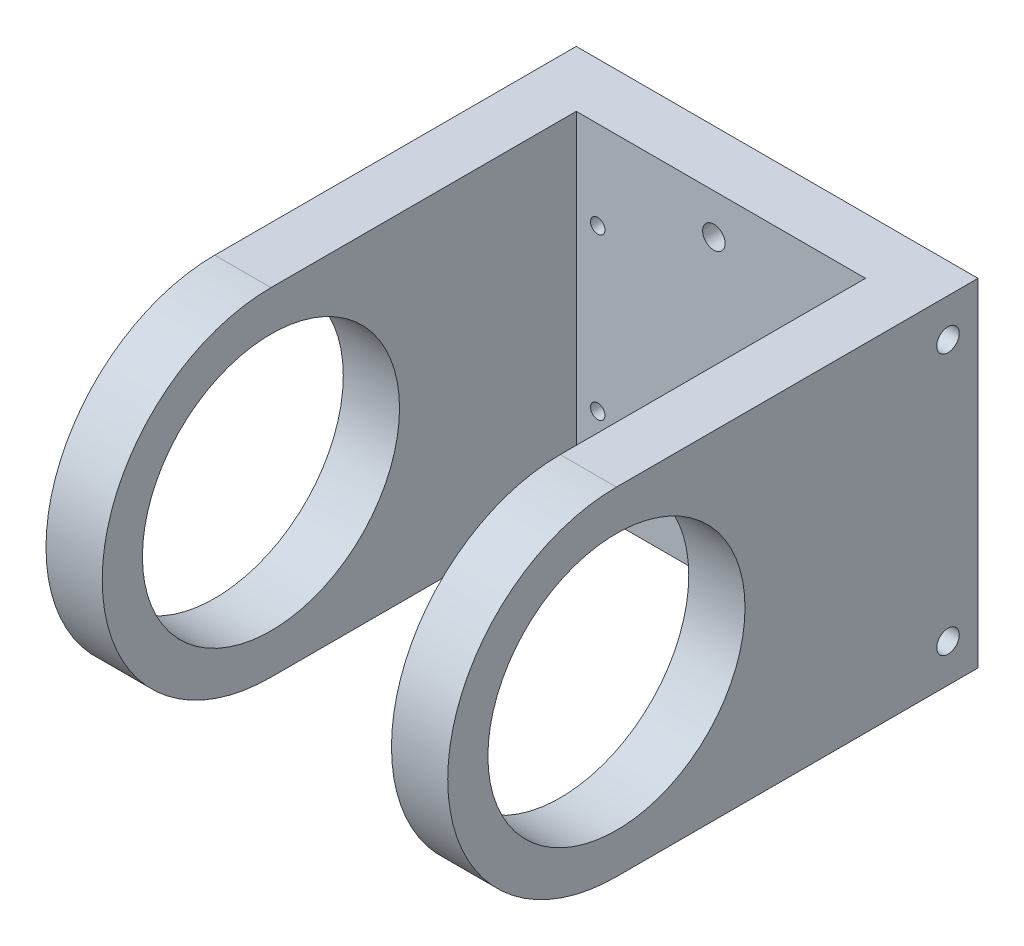
ISO-10303-21;
HEADER;
FILE_DESCRIPTION(('STEP AP214'),'2;1');
FILE_NAME('part.step','',(''),(''),'','','');
FILE_SCHEMA(('AUTOMOTIVE_DESIGN { 1 0 10303 214 1 1 1 1 }'));
ENDSEC;
DATA;
#1=APPLICATION_CONTEXT('core data for automotive mechanical design processes');
#2=APPLICATION_PROTOCOL_DEFINITION('international standard','automotive_design',2000,#1);
#3=PRODUCT_CONTEXT('',#1,'mechanical');
#4=PRODUCT('Part','Part','',(#3));
#5=PRODUCT_RELATED_PRODUCT_CATEGORY('part','',(#4));
#6=PRODUCT_DEFINITION_FORMATION('','',#4);
#7=PRODUCT_DEFINITION_CONTEXT('part definition',#1,'design');
#8=PRODUCT_DEFINITION('design','',#6,#7);
#9=PRODUCT_DEFINITION_SHAPE('','',#8);
#10=(LENGTH_UNIT() NAMED_UNIT(*) SI_UNIT(.MILLI.,.METRE.));
#11=(NAMED_UNIT(*) PLANE_ANGLE_UNIT() SI_UNIT($,.RADIAN.));
#12=(NAMED_UNIT(*) SI_UNIT($,.STERADIAN.) SOLID_ANGLE_UNIT());
#13=UNCERTAINTY_MEASURE_WITH_UNIT(LENGTH_MEASURE(1.E-05),#10,'distance_accuracy_value','');
#14=(GEOMETRIC_REPRESENTATION_CONTEXT(3) GLOBAL_UNCERTAINTY_ASSIGNED_CONTEXT((#13)) GLOBAL_UNIT_ASSIGNED_CONTEXT((#10,
#11,#12)) REPRESENTATION_CONTEXT('',''));
#15=CARTESIAN_POINT('',(0.,0.,0.));
#16=DIRECTION('',(0.,0.,1.));
#17=DIRECTION('',(1.,0.,0.));
#18=AXIS2_PLACEMENT_3D('',#15,#16,#17);
#19=CARTESIAN_POINT('',(-25.,0.,0.));
#20=DIRECTION('',(-1.,0.,0.));
#21=DIRECTION('',(0.,0.,1.));
#22=AXIS2_PLACEMENT_3D('',#19,#20,#21);
#23=CYLINDRICAL_SURFACE('',#22,21.);
#24=CARTESIAN_POINT('',(-68.,0.,0.));
#25=DIRECTION('',(-1.,0.,0.));
#26=DIRECTION('',(0.,0.,1.));
#27=AXIS2_PLACEMENT_3D('',#24,#25,#26);
#28=CIRCLE('',#27,21.);
#29=CARTESIAN_POINT('',(-68.,21.,0.));
#30=VERTEX_POINT('',#29);
#31=CARTESIAN_POINT('',(-68.,-21.,0.));
#32=VERTEX_POINT('',#31);
#33=EDGE_CURVE('E136',#30,#32,#28,.F.);
#34=ORIENTED_EDGE('',*,*,#33,.F.);
#35=DIRECTION('',(-1.,0.,0.));
#36=VECTOR('',#35,1.);
#37=CARTESIAN_POINT('',(-25.,21.,0.));
#38=LINE('',#37,#36);
#39=CARTESIAN_POINT('',(-75.,21.,0.));
#40=VERTEX_POINT('',#39);
#41=EDGE_CURVE('E149',#30,#40,#38,.T.);
#42=ORIENTED_EDGE('',*,*,#41,.T.);
#43=CARTESIAN_POINT('',(-75.,0.,0.));
#44=DIRECTION('',(-1.,0.,0.));
#45=DIRECTION('',(0.,0.,1.));
#46=AXIS2_PLACEMENT_3D('',#43,#44,#45);
#47=CIRCLE('',#46,21.);
#48=CARTESIAN_POINT('',(-75.,-21.,0.));
#49=VERTEX_POINT('',#48);
#50=EDGE_CURVE('E138',#49,#40,#47,.T.);
#51=ORIENTED_EDGE('',*,*,#50,.F.);
#52=DIRECTION('',(-1.,0.,0.));
#53=VECTOR('',#52,1.);
#54=CARTESIAN_POINT('',(-25.,-21.,0.));
#55=LINE('',#54,#53);
#56=EDGE_CURVE('E78',#32,#49,#55,.T.);
#57=ORIENTED_EDGE('',*,*,#56,.F.);
#58=EDGE_LOOP('',(#34,#42,#51,#57));
#59=FACE_BOUND('',#58,.T.);
#60=ADVANCED_FACE('F34',(#59),#23,.T.);
#61=CARTESIAN_POINT('',(-32.,0.,0.));
#62=DIRECTION('',(1.,0.,0.));
#63=DIRECTION('',(0.,0.,-1.));
#64=AXIS2_PLACEMENT_3D('',#61,#62,#63);
#65=CIRCLE('',#64,21.);
#66=CARTESIAN_POINT('',(-32.,-21.,0.));
#67=VERTEX_POINT('',#66);
#68=CARTESIAN_POINT('',(-32.,21.,0.));
#69=VERTEX_POINT('',#68);
#70=EDGE_CURVE('E48',#67,#69,#65,.F.);
#71=ORIENTED_EDGE('',*,*,#70,.F.);
#72=CARTESIAN_POINT('',(-25.,-21.,0.));
#73=VERTEX_POINT('',#72);
#74=EDGE_CURVE('E42',#73,#67,#55,.T.);
#75=ORIENTED_EDGE('',*,*,#74,.F.);
#76=CARTESIAN_POINT('',(-25.,0.,0.));
#77=DIRECTION('',(-1.,0.,0.));
#78=DIRECTION('',(0.,0.,1.));
#79=AXIS2_PLACEMENT_3D('',#76,#77,#78);
#80=CIRCLE('',#79,21.);
#81=CARTESIAN_POINT('',(-25.,21.,0.));
#82=VERTEX_POINT('',#81);
#83=EDGE_CURVE('E139',#73,#82,#80,.T.);
#84=ORIENTED_EDGE('',*,*,#83,.T.);
#85=EDGE_CURVE('E85',#82,#69,#38,.T.);
#86=ORIENTED_EDGE('',*,*,#85,.T.);
#87=EDGE_LOOP('',(#71,#75,#84,#86));
#88=FACE_BOUND('',#87,.T.);
#89=ADVANCED_FACE('F36',(#88),#23,.T.);
#90=CARTESIAN_POINT('',(-25.,-21.,-45.));
#91=DIRECTION('',(0.,-1.,0.));
#92=DIRECTION('',(0.,0.,-1.));
#93=AXIS2_PLACEMENT_3D('',#90,#91,#92);
#94=PLANE('',#93);
#95=DIRECTION('',(0.,0.,1.));
#96=VECTOR('',#95,1.);
#97=CARTESIAN_POINT('',(-68.,-21.,-38.));
#98=LINE('',#97,#96);
#99=CARTESIAN_POINT('',(-68.,-21.,-38.));
#100=VERTEX_POINT('',#99);
#101=EDGE_CURVE('E124',#100,#32,#98,.T.);
#102=ORIENTED_EDGE('',*,*,#101,.T.);
#103=ORIENTED_EDGE('',*,*,#56,.T.);
#104=DIRECTION('',(0.,0.,1.));
#105=VECTOR('',#104,1.);
#106=CARTESIAN_POINT('',(-75.,-21.,-45.));
#107=LINE('',#106,#105);
#108=CARTESIAN_POINT('',(-75.,-21.,-45.));
#109=VERTEX_POINT('',#108);
#110=EDGE_CURVE('E142',#109,#49,#107,.T.);
#111=ORIENTED_EDGE('',*,*,#110,.F.);
#112=DIRECTION('',(-1.,0.,0.));
#113=VECTOR('',#112,1.);
#114=CARTESIAN_POINT('',(-25.,-21.,-45.));
#115=LINE('',#114,#113);
#116=CARTESIAN_POINT('',(-25.,-21.,-45.));
#117=VERTEX_POINT('',#116);
#118=EDGE_CURVE('E161',#117,#109,#115,.T.);
#119=ORIENTED_EDGE('',*,*,#118,.F.);
#120=DIRECTION('',(0.,0.,1.));
#121=VECTOR('',#120,1.);
#122=CARTESIAN_POINT('',(-25.,-21.,-45.));
#123=LINE('',#122,#121);
#124=EDGE_CURVE('E147',#117,#73,#123,.T.);
#125=ORIENTED_EDGE('',*,*,#124,.T.);
#126=ORIENTED_EDGE('',*,*,#74,.T.);
#127=DIRECTION('',(0.,0.,-1.));
#128=VECTOR('',#127,1.);
#129=CARTESIAN_POINT('',(-32.,-21.,64.1638670912921));
#130=LINE('',#129,#128);
#131=CARTESIAN_POINT('',(-32.,-21.,-38.));
#132=VERTEX_POINT('',#131);
#133=EDGE_CURVE('E111',#67,#132,#130,.T.);
#134=ORIENTED_EDGE('',*,*,#133,.T.);
#135=DIRECTION('',(-1.,0.,0.));
#136=VECTOR('',#135,1.);
#137=CARTESIAN_POINT('',(-32.,-21.,-38.));
#138=LINE('',#137,#136);
#139=EDGE_CURVE('E116',#132,#100,#138,.T.);
#140=ORIENTED_EDGE('',*,*,#139,.T.);
#141=EDGE_LOOP('',(#102,#103,#111,#119,#125,#126,#134,#140));
#142=FACE_BOUND('',#141,.T.);
#143=ADVANCED_FACE('F122',(#142),#94,.T.);
#144=CARTESIAN_POINT('',(-25.,21.,-45.));
#145=DIRECTION('',(0.,0.,-1.));
#146=DIRECTION('',(-1.,0.,0.));
#147=AXIS2_PLACEMENT_3D('',#144,#145,#146);
#148=PLANE('',#147);
#149=CARTESIAN_POINT('',(-50.8768179848165,16.,-45.));
#150=DIRECTION('',(0.,0.,-1.));
#151=DIRECTION('',(-1.,0.,0.));
#152=AXIS2_PLACEMENT_3D('',#149,#150,#151);
#153=CIRCLE('',#152,1.4);
#154=CARTESIAN_POINT('',(-52.2768179848165,16.,-45.));
#155=VERTEX_POINT('',#154);
#156=EDGE_CURVE('E452',#155,#155,#153,.T.);
#157=ORIENTED_EDGE('',*,*,#156,.F.);
#158=EDGE_LOOP('',(#157));
#159=FACE_BOUND('',#158,.T.);
#160=CARTESIAN_POINT('',(-50.8768179848165,-16.,-45.));
#161=DIRECTION('',(0.,0.,-1.));
#162=DIRECTION('',(-1.,0.,0.));
#163=AXIS2_PLACEMENT_3D('',#160,#161,#162);
#164=CIRCLE('',#163,1.4);
#165=CARTESIAN_POINT('',(-52.2768179848165,-16.,-45.));
#166=VERTEX_POINT('',#165);
#167=EDGE_CURVE('E458',#166,#166,#164,.T.);
#168=ORIENTED_EDGE('',*,*,#167,.F.);
#169=EDGE_LOOP('',(#168));
#170=FACE_BOUND('',#169,.T.);
#171=CARTESIAN_POINT('',(-35.3332236,10.,-45.));
#172=DIRECTION('',(0.,0.,-1.));
#173=DIRECTION('',(-1.,0.,0.));
#174=AXIS2_PLACEMENT_3D('',#171,#172,#173);
#175=CIRCLE('',#174,0.899999999999998);
#176=CARTESIAN_POINT('',(-36.2332236,10.,-45.));
#177=VERTEX_POINT('',#176);
#178=EDGE_CURVE('E473',#177,#177,#175,.T.);
#179=ORIENTED_EDGE('',*,*,#178,.F.);
#180=EDGE_LOOP('',(#179));
#181=FACE_BOUND('',#180,.T.);
#182=CARTESIAN_POINT('',(-65.3332236,10.,-45.));
#183=DIRECTION('',(0.,0.,-1.));
#184=DIRECTION('',(-1.,0.,0.));
#185=AXIS2_PLACEMENT_3D('',#182,#183,#184);
#186=CIRCLE('',#185,0.899999999999998);
#187=CARTESIAN_POINT('',(-66.2332236,10.,-45.));
#188=VERTEX_POINT('',#187);
#189=EDGE_CURVE('E479',#188,#188,#186,.T.);
#190=ORIENTED_EDGE('',*,*,#189,.F.);
#191=EDGE_LOOP('',(#190));
#192=FACE_BOUND('',#191,.T.);
#193=CARTESIAN_POINT('',(-35.3332236,-10.,-45.));
#194=DIRECTION('',(0.,0.,-1.));
#195=DIRECTION('',(-1.,0.,0.));
#196=AXIS2_PLACEMENT_3D('',#193,#194,#195);
#197=CIRCLE('',#196,0.899999999999998);
#198=CARTESIAN_POINT('',(-36.2332236,-10.,-45.));
#199=VERTEX_POINT('',#198);
#200=EDGE_CURVE('E485',#199,#199,#197,.T.);
#201=ORIENTED_EDGE('',*,*,#200,.F.);
#202=EDGE_LOOP('',(#201));
#203=FACE_BOUND('',#202,.T.);
#204=CARTESIAN_POINT('',(-65.3332236,-10.,-45.));
#205=DIRECTION('',(0.,0.,-1.));
#206=DIRECTION('',(-1.,0.,0.));
#207=AXIS2_PLACEMENT_3D('',#204,#205,#206);
#208=CIRCLE('',#207,0.899999999999998);
#209=CARTESIAN_POINT('',(-66.2332236,-10.,-45.));
#210=VERTEX_POINT('',#209);
#211=EDGE_CURVE('E491',#210,#210,#208,.T.);
#212=ORIENTED_EDGE('',*,*,#211,.F.);
#213=EDGE_LOOP('',(#212));
#214=FACE_BOUND('',#213,.T.);
#215=DIRECTION('',(0.,-1.,0.));
#216=VECTOR('',#215,1.);
#217=CARTESIAN_POINT('',(-75.,21.,-45.));
#218=LINE('',#217,#216);
#219=CARTESIAN_POINT('',(-75.,21.,-45.));
#220=VERTEX_POINT('',#219);
#221=EDGE_CURVE('E155',#220,#109,#218,.T.);
#222=ORIENTED_EDGE('',*,*,#221,.F.);
#223=DIRECTION('',(-1.,0.,0.));
#224=VECTOR('',#223,1.);
#225=CARTESIAN_POINT('',(-25.,21.,-45.));
#226=LINE('',#225,#224);
#227=CARTESIAN_POINT('',(-25.,21.,-45.));
#228=VERTEX_POINT('',#227);
#229=EDGE_CURVE('E163',#228,#220,#226,.T.);
#230=ORIENTED_EDGE('',*,*,#229,.F.);
#231=DIRECTION('',(0.,-1.,0.));
#232=VECTOR('',#231,1.);
#233=CARTESIAN_POINT('',(-25.,21.,-45.));
#234=LINE('',#233,#232);
#235=EDGE_CURVE('E144',#228,#117,#234,.T.);
#236=ORIENTED_EDGE('',*,*,#235,.T.);
#237=ORIENTED_EDGE('',*,*,#118,.T.);
#238=EDGE_LOOP('',(#222,#230,#236,#237));
#239=FACE_BOUND('',#238,.T.);
#240=ADVANCED_FACE('F176',(#159,#170,#181,#192,#203,#214,#239),#148,.T.);
#241=CARTESIAN_POINT('',(-25.,21.,0.));
#242=DIRECTION('',(0.,1.,0.));
#243=DIRECTION('',(0.,0.,1.));
#244=AXIS2_PLACEMENT_3D('',#241,#242,#243);
#245=PLANE('',#244);
#246=DIRECTION('',(0.,0.,1.));
#247=VECTOR('',#246,1.);
#248=CARTESIAN_POINT('',(-68.,21.,-38.));
#249=LINE('',#248,#247);
#250=CARTESIAN_POINT('',(-68.,21.,-38.));
#251=VERTEX_POINT('',#250);
#252=EDGE_CURVE('E130',#251,#30,#249,.T.);
#253=ORIENTED_EDGE('',*,*,#252,.F.);
#254=DIRECTION('',(-1.,0.,0.));
#255=VECTOR('',#254,1.);
#256=CARTESIAN_POINT('',(-32.,21.,-38.));
#257=LINE('',#256,#255);
#258=CARTESIAN_POINT('',(-32.,21.,-38.));
#259=VERTEX_POINT('',#258);
#260=EDGE_CURVE('E126',#259,#251,#257,.T.);
#261=ORIENTED_EDGE('',*,*,#260,.F.);
#262=DIRECTION('',(0.,0.,-1.));
#263=VECTOR('',#262,1.);
#264=CARTESIAN_POINT('',(-32.,21.,0.));
#265=LINE('',#264,#263);
#266=EDGE_CURVE('E11',#69,#259,#265,.T.);
#267=ORIENTED_EDGE('',*,*,#266,.F.);
#268=ORIENTED_EDGE('',*,*,#85,.F.);
#269=DIRECTION('',(0.,0.,-1.));
#270=VECTOR('',#269,1.);
#271=CARTESIAN_POINT('',(-25.,21.,0.));
#272=LINE('',#271,#270);
#273=EDGE_CURVE('E141',#82,#228,#272,.T.);
#274=ORIENTED_EDGE('',*,*,#273,.T.);
#275=ORIENTED_EDGE('',*,*,#229,.T.);
#276=DIRECTION('',(0.,0.,-1.));
#277=VECTOR('',#276,1.);
#278=CARTESIAN_POINT('',(-75.,21.,0.));
#279=LINE('',#278,#277);
#280=EDGE_CURVE('E152',#40,#220,#279,.T.);
#281=ORIENTED_EDGE('',*,*,#280,.F.);
#282=ORIENTED_EDGE('',*,*,#41,.F.);
#283=EDGE_LOOP('',(#253,#261,#267,#268,#274,#275,#281,#282));
#284=FACE_BOUND('',#283,.T.);
#285=ADVANCED_FACE('F169',(#284),#245,.T.);
#286=CARTESIAN_POINT('',(-25.,0.,0.));
#287=DIRECTION('',(-1.,0.,0.));
#288=DIRECTION('',(0.,0.,1.));
#289=AXIS2_PLACEMENT_3D('',#286,#287,#288);
#290=PLANE('',#289);
#291=CARTESIAN_POINT('',(-25.,-16.25,-41.2671434810346));
#292=DIRECTION('',(1.,0.,0.));
#293=DIRECTION('',(0.,0.,-1.));
#294=AXIS2_PLACEMENT_3D('',#291,#292,#293);
#295=CIRCLE('',#294,1.4);
#296=CARTESIAN_POINT('',(-25.,-16.25,-42.6671434810346));
#297=VERTEX_POINT('',#296);
#298=EDGE_CURVE('E436',#297,#297,#295,.T.);
#299=ORIENTED_EDGE('',*,*,#298,.F.);
#300=EDGE_LOOP('',(#299));
#301=FACE_BOUND('',#300,.T.);
#302=CARTESIAN_POINT('',(-25.,16.25,-41.2671434810346));
#303=DIRECTION('',(1.,0.,0.));
#304=DIRECTION('',(0.,0.,-1.));
#305=AXIS2_PLACEMENT_3D('',#302,#303,#304);
#306=CIRCLE('',#305,1.4);
#307=CARTESIAN_POINT('',(-25.,16.25,-42.6671434810346));
#308=VERTEX_POINT('',#307);
#309=EDGE_CURVE('E441',#308,#308,#306,.T.);
#310=ORIENTED_EDGE('',*,*,#309,.F.);
#311=EDGE_LOOP('',(#310));
#312=FACE_BOUND('',#311,.T.);
#313=CARTESIAN_POINT('',(-25.,0.,0.));
#314=DIRECTION('',(1.,0.,0.));
#315=DIRECTION('',(0.,0.,-1.));
#316=AXIS2_PLACEMENT_3D('',#313,#314,#315);
#317=CIRCLE('',#316,16.);
#318=CARTESIAN_POINT('',(-25.,0.,-16.));
#319=VERTEX_POINT('',#318);
#320=EDGE_CURVE('E467',#319,#319,#317,.T.);
#321=ORIENTED_EDGE('',*,*,#320,.F.);
#322=EDGE_LOOP('',(#321));
#323=FACE_BOUND('',#322,.T.);
#324=ORIENTED_EDGE('',*,*,#83,.F.);
#325=ORIENTED_EDGE('',*,*,#124,.F.);
#326=ORIENTED_EDGE('',*,*,#235,.F.);
#327=ORIENTED_EDGE('',*,*,#273,.F.);
#328=EDGE_LOOP('',(#324,#325,#326,#327));
#329=FACE_BOUND('',#328,.T.);
#330=ADVANCED_FACE('F178',(#301,#312,#323,#329),#290,.F.);
#331=CARTESIAN_POINT('',(-75.,0.,0.));
#332=DIRECTION('',(-1.,0.,0.));
#333=DIRECTION('',(0.,0.,1.));
#334=AXIS2_PLACEMENT_3D('',#331,#332,#333);
#335=PLANE('',#334);
#336=CARTESIAN_POINT('',(-75.,-16.25,-41.2671434810346));
#337=DIRECTION('',(1.,0.,0.));
#338=DIRECTION('',(0.,0.,-1.));
#339=AXIS2_PLACEMENT_3D('',#336,#337,#338);
#340=CIRCLE('',#339,1.4);
#341=CARTESIAN_POINT('',(-75.,-16.25,-42.6671434810346));
#342=VERTEX_POINT('',#341);
#343=EDGE_CURVE('E427',#342,#342,#340,.T.);
#344=ORIENTED_EDGE('',*,*,#343,.T.);
#345=EDGE_LOOP('',(#344));
#346=FACE_BOUND('',#345,.T.);
#347=CARTESIAN_POINT('',(-75.,16.25,-41.2671434810346));
#348=DIRECTION('',(1.,0.,0.));
#349=DIRECTION('',(0.,0.,-1.));
#350=AXIS2_PLACEMENT_3D('',#347,#348,#349);
#351=CIRCLE('',#350,1.4);
#352=CARTESIAN_POINT('',(-75.,16.25,-42.6671434810346));
#353=VERTEX_POINT('',#352);
#354=EDGE_CURVE('E426',#353,#353,#351,.T.);
#355=ORIENTED_EDGE('',*,*,#354,.T.);
#356=EDGE_LOOP('',(#355));
#357=FACE_BOUND('',#356,.T.);
#358=CARTESIAN_POINT('',(-75.,0.,0.));
#359=DIRECTION('',(-1.,0.,0.));
#360=DIRECTION('',(0.,0.,1.));
#361=AXIS2_PLACEMENT_3D('',#358,#359,#360);
#362=CIRCLE('',#361,16.);
#363=CARTESIAN_POINT('',(-75.,0.,16.));
#364=VERTEX_POINT('',#363);
#365=EDGE_CURVE('E461',#364,#364,#362,.T.);
#366=ORIENTED_EDGE('',*,*,#365,.F.);
#367=EDGE_LOOP('',(#366));
#368=FACE_BOUND('',#367,.T.);
#369=ORIENTED_EDGE('',*,*,#50,.T.);
#370=ORIENTED_EDGE('',*,*,#280,.T.);
#371=ORIENTED_EDGE('',*,*,#221,.T.);
#372=ORIENTED_EDGE('',*,*,#110,.T.);
#373=EDGE_LOOP('',(#369,#370,#371,#372));
#374=FACE_BOUND('',#373,.T.);
#375=ADVANCED_FACE('F172',(#346,#357,#368,#374),#335,.T.);
#376=CARTESIAN_POINT('',(-68.,-21.,-38.));
#377=DIRECTION('',(-1.,0.,0.));
#378=DIRECTION('',(0.,0.,1.));
#379=AXIS2_PLACEMENT_3D('',#376,#377,#378);
#380=PLANE('',#379);
#381=CARTESIAN_POINT('',(-68.,0.,0.));
#382=DIRECTION('',(-1.,0.,0.));
#383=DIRECTION('',(0.,0.,1.));
#384=AXIS2_PLACEMENT_3D('',#381,#382,#383);
#385=CIRCLE('',#384,16.);
#386=CARTESIAN_POINT('',(-68.,0.,16.));
#387=VERTEX_POINT('',#386);
#388=EDGE_CURVE('E464',#387,#387,#385,.T.);
#389=ORIENTED_EDGE('',*,*,#388,.T.);
#390=EDGE_LOOP('',(#389));
#391=FACE_BOUND('',#390,.T.);
#392=ORIENTED_EDGE('',*,*,#33,.T.);
#393=ORIENTED_EDGE('',*,*,#101,.F.);
#394=DIRECTION('',(0.,1.,0.));
#395=VECTOR('',#394,1.);
#396=CARTESIAN_POINT('',(-68.,-21.,-38.));
#397=LINE('',#396,#395);
#398=EDGE_CURVE('E115',#100,#251,#397,.T.);
#399=ORIENTED_EDGE('',*,*,#398,.T.);
#400=ORIENTED_EDGE('',*,*,#252,.T.);
#401=EDGE_LOOP('',(#392,#393,#399,#400));
#402=FACE_BOUND('',#401,.T.);
#403=ADVANCED_FACE('F279',(#391,#402),#380,.F.);
#404=CARTESIAN_POINT('',(-32.,-21.,-38.));
#405=DIRECTION('',(0.,0.,-1.));
#406=DIRECTION('',(-1.,0.,0.));
#407=AXIS2_PLACEMENT_3D('',#404,#405,#406);
#408=PLANE('',#407);
#409=CARTESIAN_POINT('',(-50.8768179848165,16.,-38.));
#410=DIRECTION('',(0.,0.,1.));
#411=DIRECTION('',(1.,0.,0.));
#412=AXIS2_PLACEMENT_3D('',#409,#410,#411);
#413=CIRCLE('',#412,1.4);
#414=CARTESIAN_POINT('',(-49.4768179848165,16.,-38.));
#415=VERTEX_POINT('',#414);
#416=EDGE_CURVE('E447',#415,#415,#413,.T.);
#417=ORIENTED_EDGE('',*,*,#416,.F.);
#418=EDGE_LOOP('',(#417));
#419=FACE_BOUND('',#418,.T.);
#420=CARTESIAN_POINT('',(-50.8768179848165,-16.,-38.));
#421=DIRECTION('',(0.,0.,1.));
#422=DIRECTION('',(1.,0.,0.));
#423=AXIS2_PLACEMENT_3D('',#420,#421,#422);
#424=CIRCLE('',#423,1.4);
#425=CARTESIAN_POINT('',(-49.4768179848165,-16.,-38.));
#426=VERTEX_POINT('',#425);
#427=EDGE_CURVE('E455',#426,#426,#424,.T.);
#428=ORIENTED_EDGE('',*,*,#427,.F.);
#429=EDGE_LOOP('',(#428));
#430=FACE_BOUND('',#429,.T.);
#431=CARTESIAN_POINT('',(-35.3332236,10.,-38.));
#432=DIRECTION('',(0.,0.,-1.));
#433=DIRECTION('',(-1.,0.,0.));
#434=AXIS2_PLACEMENT_3D('',#431,#432,#433);
#435=CIRCLE('',#434,0.899999999999998);
#436=CARTESIAN_POINT('',(-36.2332236,10.,-38.));
#437=VERTEX_POINT('',#436);
#438=EDGE_CURVE('E476',#437,#437,#435,.T.);
#439=ORIENTED_EDGE('',*,*,#438,.T.);
#440=EDGE_LOOP('',(#439));
#441=FACE_BOUND('',#440,.T.);
#442=CARTESIAN_POINT('',(-65.3332236,10.,-38.));
#443=DIRECTION('',(0.,0.,-1.));
#444=DIRECTION('',(-1.,0.,0.));
#445=AXIS2_PLACEMENT_3D('',#442,#443,#444);
#446=CIRCLE('',#445,0.899999999999998);
#447=CARTESIAN_POINT('',(-66.2332236,10.,-38.));
#448=VERTEX_POINT('',#447);
#449=EDGE_CURVE('E482',#448,#448,#446,.T.);
#450=ORIENTED_EDGE('',*,*,#449,.T.);
#451=EDGE_LOOP('',(#450));
#452=FACE_BOUND('',#451,.T.);
#453=CARTESIAN_POINT('',(-35.3332236,-10.,-38.));
#454=DIRECTION('',(0.,0.,-1.));
#455=DIRECTION('',(-1.,0.,0.));
#456=AXIS2_PLACEMENT_3D('',#453,#454,#455);
#457=CIRCLE('',#456,0.899999999999998);
#458=CARTESIAN_POINT('',(-36.2332236,-10.,-38.));
#459=VERTEX_POINT('',#458);
#460=EDGE_CURVE('E488',#459,#459,#457,.T.);
#461=ORIENTED_EDGE('',*,*,#460,.T.);
#462=EDGE_LOOP('',(#461));
#463=FACE_BOUND('',#462,.T.);
#464=CARTESIAN_POINT('',(-65.3332236,-10.,-38.));
#465=DIRECTION('',(0.,0.,-1.));
#466=DIRECTION('',(-1.,0.,0.));
#467=AXIS2_PLACEMENT_3D('',#464,#465,#466);
#468=CIRCLE('',#467,0.899999999999998);
#469=CARTESIAN_POINT('',(-66.2332236,-10.,-38.));
#470=VERTEX_POINT('',#469);
#471=EDGE_CURVE('E132',#470,#470,#468,.T.);
#472=ORIENTED_EDGE('',*,*,#471,.T.);
#473=EDGE_LOOP('',(#472));
#474=FACE_BOUND('',#473,.T.);
#475=ORIENTED_EDGE('',*,*,#260,.T.);
#476=ORIENTED_EDGE('',*,*,#398,.F.);
#477=ORIENTED_EDGE('',*,*,#139,.F.);
#478=DIRECTION('',(0.,1.,0.));
#479=VECTOR('',#478,1.);
#480=CARTESIAN_POINT('',(-32.,-21.,-38.));
#481=LINE('',#480,#479);
#482=EDGE_CURVE('E107',#132,#259,#481,.T.);
#483=ORIENTED_EDGE('',*,*,#482,.T.);
#484=EDGE_LOOP('',(#475,#476,#477,#483));
#485=FACE_BOUND('',#484,.T.);
#486=ADVANCED_FACE('F119',(#419,#430,#441,#452,#463,#474,#485),#408,.F.);
#487=CARTESIAN_POINT('',(-32.,-21.,64.1638670912921));
#488=DIRECTION('',(1.,0.,0.));
#489=DIRECTION('',(0.,0.,-1.));
#490=AXIS2_PLACEMENT_3D('',#487,#488,#489);
#491=PLANE('',#490);
#492=CARTESIAN_POINT('',(-32.,0.,0.));
#493=DIRECTION('',(1.,0.,0.));
#494=DIRECTION('',(0.,0.,-1.));
#495=AXIS2_PLACEMENT_3D('',#492,#493,#494);
#496=CIRCLE('',#495,16.);
#497=CARTESIAN_POINT('',(-32.,0.,-16.));
#498=VERTEX_POINT('',#497);
#499=EDGE_CURVE('E470',#498,#498,#496,.T.);
#500=ORIENTED_EDGE('',*,*,#499,.T.);
#501=EDGE_LOOP('',(#500));
#502=FACE_BOUND('',#501,.T.);
#503=ORIENTED_EDGE('',*,*,#70,.T.);
#504=ORIENTED_EDGE('',*,*,#266,.T.);
#505=ORIENTED_EDGE('',*,*,#482,.F.);
#506=ORIENTED_EDGE('',*,*,#133,.F.);
#507=EDGE_LOOP('',(#503,#504,#505,#506));
#508=FACE_BOUND('',#507,.T.);
#509=ADVANCED_FACE('F109',(#502,#508),#491,.F.);
#510=CARTESIAN_POINT('',(-65.3332236,-10.,-45.));
#511=DIRECTION('',(0.,0.,-1.));
#512=DIRECTION('',(-1.,0.,0.));
#513=AXIS2_PLACEMENT_3D('',#510,#511,#512);
#514=CYLINDRICAL_SURFACE('',#513,0.899999999999998);
#515=ORIENTED_EDGE('',*,*,#471,.F.);
#516=EDGE_LOOP('',(#515));
#517=FACE_BOUND('',#516,.T.);
#518=ORIENTED_EDGE('',*,*,#211,.T.);
#519=EDGE_LOOP('',(#518));
#520=FACE_BOUND('',#519,.T.);
#521=ADVANCED_FACE('F215',(#517,#520),#514,.F.);
#522=CARTESIAN_POINT('',(-35.3332236,-10.,-45.));
#523=DIRECTION('',(0.,0.,-1.));
#524=DIRECTION('',(-1.,0.,0.));
#525=AXIS2_PLACEMENT_3D('',#522,#523,#524);
#526=CYLINDRICAL_SURFACE('',#525,0.899999999999998);
#527=ORIENTED_EDGE('',*,*,#460,.F.);
#528=EDGE_LOOP('',(#527));
#529=FACE_BOUND('',#528,.T.);
#530=ORIENTED_EDGE('',*,*,#200,.T.);
#531=EDGE_LOOP('',(#530));
#532=FACE_BOUND('',#531,.T.);
#533=ADVANCED_FACE('F220',(#529,#532),#526,.F.);
#534=CARTESIAN_POINT('',(-65.3332236,10.,-45.));
#535=DIRECTION('',(0.,0.,-1.));
#536=DIRECTION('',(-1.,0.,0.));
#537=AXIS2_PLACEMENT_3D('',#534,#535,#536);
#538=CYLINDRICAL_SURFACE('',#537,0.899999999999998);
#539=ORIENTED_EDGE('',*,*,#449,.F.);
#540=EDGE_LOOP('',(#539));
#541=FACE_BOUND('',#540,.T.);
#542=ORIENTED_EDGE('',*,*,#189,.T.);
#543=EDGE_LOOP('',(#542));
#544=FACE_BOUND('',#543,.T.);
#545=ADVANCED_FACE('F232',(#541,#544),#538,.F.);
#546=CARTESIAN_POINT('',(-35.3332236,10.,-45.));
#547=DIRECTION('',(0.,0.,-1.));
#548=DIRECTION('',(-1.,0.,0.));
#549=AXIS2_PLACEMENT_3D('',#546,#547,#548);
#550=CYLINDRICAL_SURFACE('',#549,0.899999999999998);
#551=ORIENTED_EDGE('',*,*,#438,.F.);
#552=EDGE_LOOP('',(#551));
#553=FACE_BOUND('',#552,.T.);
#554=ORIENTED_EDGE('',*,*,#178,.T.);
#555=EDGE_LOOP('',(#554));
#556=FACE_BOUND('',#555,.T.);
#557=ADVANCED_FACE('F242',(#553,#556),#550,.F.);
#558=CARTESIAN_POINT('',(-25.,0.,0.));
#559=DIRECTION('',(1.,0.,0.));
#560=DIRECTION('',(0.,0.,-1.));
#561=AXIS2_PLACEMENT_3D('',#558,#559,#560);
#562=CYLINDRICAL_SURFACE('',#561,16.);
#563=ORIENTED_EDGE('',*,*,#499,.F.);
#564=EDGE_LOOP('',(#563));
#565=FACE_BOUND('',#564,.T.);
#566=ORIENTED_EDGE('',*,*,#320,.T.);
#567=EDGE_LOOP('',(#566));
#568=FACE_BOUND('',#567,.T.);
#569=ADVANCED_FACE('F252',(#565,#568),#562,.F.);
#570=CARTESIAN_POINT('',(-75.,0.,0.));
#571=DIRECTION('',(-1.,0.,0.));
#572=DIRECTION('',(0.,0.,1.));
#573=AXIS2_PLACEMENT_3D('',#570,#571,#572);
#574=CYLINDRICAL_SURFACE('',#573,16.);
#575=ORIENTED_EDGE('',*,*,#388,.F.);
#576=EDGE_LOOP('',(#575));
#577=FACE_BOUND('',#576,.T.);
#578=ORIENTED_EDGE('',*,*,#365,.T.);
#579=EDGE_LOOP('',(#578));
#580=FACE_BOUND('',#579,.T.);
#581=ADVANCED_FACE('F271',(#577,#580),#574,.F.);
#582=CARTESIAN_POINT('',(-50.8768179848165,-16.,-48.));
#583=DIRECTION('',(0.,0.,1.));
#584=DIRECTION('',(1.,0.,0.));
#585=AXIS2_PLACEMENT_3D('',#582,#583,#584);
#586=CYLINDRICAL_SURFACE('',#585,1.4);
#587=ORIENTED_EDGE('',*,*,#167,.T.);
#588=EDGE_LOOP('',(#587));
#589=FACE_BOUND('',#588,.T.);
#590=ORIENTED_EDGE('',*,*,#427,.T.);
#591=EDGE_LOOP('',(#590));
#592=FACE_BOUND('',#591,.T.);
#593=ADVANCED_FACE('F291',(#589,#592),#586,.F.);
#594=CARTESIAN_POINT('',(-50.8768179848165,16.,-48.));
#595=DIRECTION('',(0.,0.,1.));
#596=DIRECTION('',(1.,0.,0.));
#597=AXIS2_PLACEMENT_3D('',#594,#595,#596);
#598=CYLINDRICAL_SURFACE('',#597,1.4);
#599=ORIENTED_EDGE('',*,*,#156,.T.);
#600=EDGE_LOOP('',(#599));
#601=FACE_BOUND('',#600,.T.);
#602=ORIENTED_EDGE('',*,*,#416,.T.);
#603=EDGE_LOOP('',(#602));
#604=FACE_BOUND('',#603,.T.);
#605=ADVANCED_FACE('F315',(#601,#604),#598,.F.);
#606=CARTESIAN_POINT('',(-29.,16.25,-41.2671434810346));
#607=DIRECTION('',(1.,0.,0.));
#608=DIRECTION('',(0.,0.,-1.));
#609=AXIS2_PLACEMENT_3D('',#606,#607,#608);
#610=CYLINDRICAL_SURFACE('',#609,1.4);
#611=CARTESIAN_POINT('',(-29.,16.25,-41.2671434810346));
#612=DIRECTION('',(1.,0.,0.));
#613=DIRECTION('',(0.,0.,-1.));
#614=AXIS2_PLACEMENT_3D('',#611,#612,#613);
#615=CIRCLE('',#614,1.4);
#616=CARTESIAN_POINT('',(-29.,16.25,-42.6671434810346));
#617=VERTEX_POINT('',#616);
#618=EDGE_CURVE('E444',#617,#617,#615,.T.);
#619=ORIENTED_EDGE('',*,*,#618,.F.);
#620=EDGE_LOOP('',(#619));
#621=FACE_BOUND('',#620,.T.);
#622=ORIENTED_EDGE('',*,*,#309,.T.);
#623=EDGE_LOOP('',(#622));
#624=FACE_BOUND('',#623,.T.);
#625=ADVANCED_FACE('F325',(#621,#624),#610,.F.);
#626=CARTESIAN_POINT('',(-29.,16.25,-41.2671434810346));
#627=DIRECTION('',(1.,0.,0.));
#628=DIRECTION('',(0.,0.,-1.));
#629=AXIS2_PLACEMENT_3D('',#626,#627,#628);
#630=PLANE('',#629);
#631=ORIENTED_EDGE('',*,*,#618,.T.);
#632=EDGE_LOOP('',(#631));
#633=FACE_BOUND('',#632,.T.);
#634=ADVANCED_FACE('F342',(#633),#630,.T.);
#635=CARTESIAN_POINT('',(-29.,-16.25,-41.2671434810346));
#636=DIRECTION('',(1.,0.,0.));
#637=DIRECTION('',(0.,0.,-1.));
#638=AXIS2_PLACEMENT_3D('',#635,#636,#637);
#639=CYLINDRICAL_SURFACE('',#638,1.4);
#640=CARTESIAN_POINT('',(-29.,-16.25,-41.2671434810346));
#641=DIRECTION('',(1.,0.,0.));
#642=DIRECTION('',(0.,0.,-1.));
#643=AXIS2_PLACEMENT_3D('',#640,#641,#642);
#644=CIRCLE('',#643,1.4);
#645=CARTESIAN_POINT('',(-29.,-16.25,-42.6671434810346));
#646=VERTEX_POINT('',#645);
#647=EDGE_CURVE('E438',#646,#646,#644,.T.);
#648=ORIENTED_EDGE('',*,*,#647,.F.);
#649=EDGE_LOOP('',(#648));
#650=FACE_BOUND('',#649,.T.);
#651=ORIENTED_EDGE('',*,*,#298,.T.);
#652=EDGE_LOOP('',(#651));
#653=FACE_BOUND('',#652,.T.);
#654=ADVANCED_FACE('F352',(#650,#653),#639,.F.);
#655=CARTESIAN_POINT('',(-29.,-16.25,-41.2671434810346));
#656=DIRECTION('',(1.,0.,0.));
#657=DIRECTION('',(0.,0.,-1.));
#658=AXIS2_PLACEMENT_3D('',#655,#656,#657);
#659=PLANE('',#658);
#660=ORIENTED_EDGE('',*,*,#647,.T.);
#661=EDGE_LOOP('',(#660));
#662=FACE_BOUND('',#661,.T.);
#663=ADVANCED_FACE('F362',(#662),#659,.T.);
#664=CARTESIAN_POINT('',(-71.,16.25,-41.2671434810346));
#665=DIRECTION('',(-1.,0.,0.));
#666=DIRECTION('',(0.,0.,1.));
#667=AXIS2_PLACEMENT_3D('',#664,#665,#666);
#668=CYLINDRICAL_SURFACE('',#667,1.4);
#669=CARTESIAN_POINT('',(-71.,16.25,-41.2671434810346));
#670=DIRECTION('',(1.,0.,0.));
#671=DIRECTION('',(0.,0.,-1.));
#672=AXIS2_PLACEMENT_3D('',#669,#670,#671);
#673=CIRCLE('',#672,1.4);
#674=CARTESIAN_POINT('',(-71.,16.25,-42.6671434810346));
#675=VERTEX_POINT('',#674);
#676=EDGE_CURVE('E430',#675,#675,#673,.T.);
#677=ORIENTED_EDGE('',*,*,#676,.T.);
#678=EDGE_LOOP('',(#677));
#679=FACE_BOUND('',#678,.T.);
#680=ORIENTED_EDGE('',*,*,#354,.F.);
#681=EDGE_LOOP('',(#680));
#682=FACE_BOUND('',#681,.T.);
#683=ADVANCED_FACE('F372',(#679,#682),#668,.F.);
#684=CARTESIAN_POINT('',(-71.,16.25,-41.2671434810346));
#685=DIRECTION('',(-1.,0.,0.));
#686=DIRECTION('',(0.,0.,-1.));
#687=AXIS2_PLACEMENT_3D('',#684,#685,#686);
#688=PLANE('',#687);
#689=ORIENTED_EDGE('',*,*,#676,.F.);
#690=EDGE_LOOP('',(#689));
#691=FACE_BOUND('',#690,.T.);
#692=ADVANCED_FACE('F389',(#691),#688,.T.);
#693=CARTESIAN_POINT('',(-71.,-16.25,-41.2671434810346));
#694=DIRECTION('',(-1.,0.,0.));
#695=DIRECTION('',(0.,0.,1.));
#696=AXIS2_PLACEMENT_3D('',#693,#694,#695);
#697=CYLINDRICAL_SURFACE('',#696,1.4);
#698=CARTESIAN_POINT('',(-71.,-16.25,-41.2671434810346));
#699=DIRECTION('',(1.,0.,0.));
#700=DIRECTION('',(0.,0.,-1.));
#701=AXIS2_PLACEMENT_3D('',#698,#699,#700);
#702=CIRCLE('',#701,1.4);
#703=CARTESIAN_POINT('',(-71.,-16.25,-42.6671434810346));
#704=VERTEX_POINT('',#703);
#705=EDGE_CURVE('E425',#704,#704,#702,.T.);
#706=ORIENTED_EDGE('',*,*,#705,.T.);
#707=EDGE_LOOP('',(#706));
#708=FACE_BOUND('',#707,.T.);
#709=ORIENTED_EDGE('',*,*,#343,.F.);
#710=EDGE_LOOP('',(#709));
#711=FACE_BOUND('',#710,.T.);
#712=ADVANCED_FACE('F399',(#708,#711),#697,.F.);
#713=CARTESIAN_POINT('',(-71.,-16.25,-41.2671434810346));
#714=DIRECTION('',(-1.,0.,0.));
#715=DIRECTION('',(0.,0.,-1.));
#716=AXIS2_PLACEMENT_3D('',#713,#714,#715);
#717=PLANE('',#716);
#718=ORIENTED_EDGE('',*,*,#705,.F.);
#719=EDGE_LOOP('',(#718));
#720=FACE_BOUND('',#719,.T.);
#721=ADVANCED_FACE('F409',(#720),#717,.T.);
#722=CLOSED_SHELL('',(#60,#89,#143,#240,#285,#330,#375,#403,#486,#509,#521,#533,#545,#557,#569,
#581,#593,#605,#625,#634,#654,#663,#683,#692,#712,#721));
#723=MANIFOLD_SOLID_BREP('B2',#722);
#724=ADVANCED_BREP_SHAPE_REPRESENTATION('',(#18,#723),#14);
#725=SHAPE_DEFINITION_REPRESENTATION(#9,#724);
ENDSEC;
END-ISO-10303-21;
